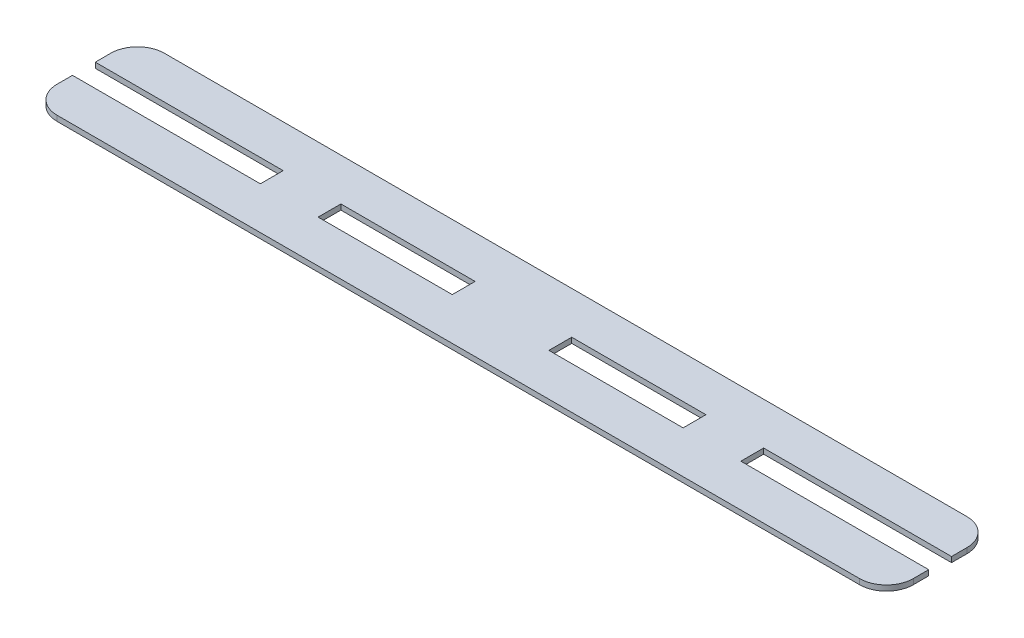
ISO-10303-21;
HEADER;
FILE_DESCRIPTION(('STEP AP214'),'2;1');
FILE_NAME('part.step','',(''),(''),'','','');
FILE_SCHEMA(('AUTOMOTIVE_DESIGN { 1 0 10303 214 1 1 1 1 }'));
ENDSEC;
DATA;
#1=APPLICATION_CONTEXT('core data for automotive mechanical design processes');
#2=APPLICATION_PROTOCOL_DEFINITION('international standard','automotive_design',2000,#1);
#3=PRODUCT_CONTEXT('',#1,'mechanical');
#4=PRODUCT('Part','Part','',(#3));
#5=PRODUCT_RELATED_PRODUCT_CATEGORY('part','',(#4));
#6=PRODUCT_DEFINITION_FORMATION('','',#4);
#7=PRODUCT_DEFINITION_CONTEXT('part definition',#1,'design');
#8=PRODUCT_DEFINITION('design','',#6,#7);
#9=PRODUCT_DEFINITION_SHAPE('','',#8);
#10=(LENGTH_UNIT() NAMED_UNIT(*) SI_UNIT(.MILLI.,.METRE.));
#11=(NAMED_UNIT(*) PLANE_ANGLE_UNIT() SI_UNIT($,.RADIAN.));
#12=(NAMED_UNIT(*) SI_UNIT($,.STERADIAN.) SOLID_ANGLE_UNIT());
#13=UNCERTAINTY_MEASURE_WITH_UNIT(LENGTH_MEASURE(1.E-05),#10,'distance_accuracy_value','');
#14=(GEOMETRIC_REPRESENTATION_CONTEXT(3) GLOBAL_UNCERTAINTY_ASSIGNED_CONTEXT((#13)) GLOBAL_UNIT_ASSIGNED_CONTEXT((#10,
#11,#12)) REPRESENTATION_CONTEXT('',''));
#15=CARTESIAN_POINT('',(0.,0.,0.));
#16=DIRECTION('',(0.,0.,1.));
#17=DIRECTION('',(1.,0.,0.));
#18=AXIS2_PLACEMENT_3D('',#15,#16,#17);
#19=CARTESIAN_POINT('',(0.,2.,0.));
#20=DIRECTION('',(0.,1.,0.));
#21=DIRECTION('',(0.,0.,1.));
#22=AXIS2_PLACEMENT_3D('',#19,#20,#21);
#23=PLANE('',#22);
#24=DIRECTION('',(0.,0.,1.));
#25=VECTOR('',#24,1.);
#26=CARTESIAN_POINT('',(91.5,2.,15.75));
#27=LINE('',#26,#25);
#28=CARTESIAN_POINT('',(91.5,2.,15.75));
#29=VERTEX_POINT('',#28);
#30=CARTESIAN_POINT('',(91.5,2.,24.25));
#31=VERTEX_POINT('',#30);
#32=EDGE_CURVE('E293',#29,#31,#27,.T.);
#33=ORIENTED_EDGE('',*,*,#32,.F.);
#34=DIRECTION('',(-1.,0.,0.));
#35=VECTOR('',#34,1.);
#36=CARTESIAN_POINT('',(91.5,2.,15.75));
#37=LINE('',#36,#35);
#38=CARTESIAN_POINT('',(141.5,2.,15.75));
#39=VERTEX_POINT('',#38);
#40=EDGE_CURVE('E306',#39,#29,#37,.T.);
#41=ORIENTED_EDGE('',*,*,#40,.F.);
#42=DIRECTION('',(0.,0.,-1.));
#43=VECTOR('',#42,1.);
#44=CARTESIAN_POINT('',(141.5,2.,15.75));
#45=LINE('',#44,#43);
#46=CARTESIAN_POINT('',(141.5,2.,24.25));
#47=VERTEX_POINT('',#46);
#48=EDGE_CURVE('E325',#47,#39,#45,.T.);
#49=ORIENTED_EDGE('',*,*,#48,.F.);
#50=DIRECTION('',(1.,0.,0.));
#51=VECTOR('',#50,1.);
#52=CARTESIAN_POINT('',(91.5,2.,24.25));
#53=LINE('',#52,#51);
#54=EDGE_CURVE('E321',#31,#47,#53,.T.);
#55=ORIENTED_EDGE('',*,*,#54,.F.);
#56=EDGE_LOOP('',(#33,#41,#49,#55));
#57=FACE_BOUND('',#56,.T.);
#58=DIRECTION('',(0.,0.,1.));
#59=VECTOR('',#58,1.);
#60=CARTESIAN_POINT('',(0.,2.,0.));
#61=LINE('',#60,#59);
#62=CARTESIAN_POINT('',(0.,2.,24.25));
#63=VERTEX_POINT('',#62);
#64=CARTESIAN_POINT('',(0.,2.,30.));
#65=VERTEX_POINT('',#64);
#66=EDGE_CURVE('E386',#63,#65,#61,.T.);
#67=ORIENTED_EDGE('',*,*,#66,.T.);
#68=CARTESIAN_POINT('',(10.,2.,30.));
#69=DIRECTION('',(0.,1.,0.));
#70=DIRECTION('',(0.,0.,1.));
#71=AXIS2_PLACEMENT_3D('',#68,#69,#70);
#72=CIRCLE('',#71,10.);
#73=CARTESIAN_POINT('',(10.,2.,40.));
#74=VERTEX_POINT('',#73);
#75=EDGE_CURVE('E431',#65,#74,#72,.T.);
#76=ORIENTED_EDGE('',*,*,#75,.T.);
#77=DIRECTION('',(1.,0.,0.));
#78=VECTOR('',#77,1.);
#79=CARTESIAN_POINT('',(0.,2.,40.));
#80=LINE('',#79,#78);
#81=CARTESIAN_POINT('',(309.,2.,40.));
#82=VERTEX_POINT('',#81);
#83=EDGE_CURVE('E385',#74,#82,#80,.T.);
#84=ORIENTED_EDGE('',*,*,#83,.T.);
#85=CARTESIAN_POINT('',(309.,2.,30.));
#86=DIRECTION('',(0.,1.,0.));
#87=DIRECTION('',(0.,0.,1.));
#88=AXIS2_PLACEMENT_3D('',#85,#86,#87);
#89=CIRCLE('',#88,10.);
#90=CARTESIAN_POINT('',(319.,2.,30.));
#91=VERTEX_POINT('',#90);
#92=EDGE_CURVE('E428',#82,#91,#89,.T.);
#93=ORIENTED_EDGE('',*,*,#92,.T.);
#94=DIRECTION('',(0.,0.,-1.));
#95=VECTOR('',#94,1.);
#96=CARTESIAN_POINT('',(319.,2.,0.));
#97=LINE('',#96,#95);
#98=CARTESIAN_POINT('',(319.,2.,24.25));
#99=VERTEX_POINT('',#98);
#100=EDGE_CURVE('E391',#91,#99,#97,.T.);
#101=ORIENTED_EDGE('',*,*,#100,.T.);
#102=DIRECTION('',(-1.,0.,0.));
#103=VECTOR('',#102,1.);
#104=CARTESIAN_POINT('',(319.,2.,24.25));
#105=LINE('',#104,#103);
#106=CARTESIAN_POINT('',(249.,2.,24.25));
#107=VERTEX_POINT('',#106);
#108=EDGE_CURVE('E271',#99,#107,#105,.T.);
#109=ORIENTED_EDGE('',*,*,#108,.T.);
#110=DIRECTION('',(0.,0.,-1.));
#111=VECTOR('',#110,1.);
#112=CARTESIAN_POINT('',(249.,2.,24.25));
#113=LINE('',#112,#111);
#114=CARTESIAN_POINT('',(249.,2.,15.75));
#115=VERTEX_POINT('',#114);
#116=EDGE_CURVE('E282',#107,#115,#113,.T.);
#117=ORIENTED_EDGE('',*,*,#116,.T.);
#118=DIRECTION('',(1.,0.,0.));
#119=VECTOR('',#118,1.);
#120=CARTESIAN_POINT('',(319.,2.,15.75));
#121=LINE('',#120,#119);
#122=CARTESIAN_POINT('',(319.,2.,15.75));
#123=VERTEX_POINT('',#122);
#124=EDGE_CURVE('E261',#115,#123,#121,.T.);
#125=ORIENTED_EDGE('',*,*,#124,.T.);
#126=CARTESIAN_POINT('',(319.,2.,10.));
#127=VERTEX_POINT('',#126);
#128=EDGE_CURVE('E390',#123,#127,#97,.T.);
#129=ORIENTED_EDGE('',*,*,#128,.T.);
#130=CARTESIAN_POINT('',(309.,2.,10.));
#131=DIRECTION('',(0.,1.,0.));
#132=DIRECTION('',(0.,0.,1.));
#133=AXIS2_PLACEMENT_3D('',#130,#131,#132);
#134=CIRCLE('',#133,10.);
#135=CARTESIAN_POINT('',(309.,2.,0.));
#136=VERTEX_POINT('',#135);
#137=EDGE_CURVE('E426',#127,#136,#134,.T.);
#138=ORIENTED_EDGE('',*,*,#137,.T.);
#139=DIRECTION('',(-1.,0.,0.));
#140=VECTOR('',#139,1.);
#141=CARTESIAN_POINT('',(0.,2.,0.));
#142=LINE('',#141,#140);
#143=CARTESIAN_POINT('',(10.,2.,0.));
#144=VERTEX_POINT('',#143);
#145=EDGE_CURVE('E394',#136,#144,#142,.T.);
#146=ORIENTED_EDGE('',*,*,#145,.T.);
#147=CARTESIAN_POINT('',(10.,2.,10.));
#148=DIRECTION('',(0.,1.,0.));
#149=DIRECTION('',(0.,0.,1.));
#150=AXIS2_PLACEMENT_3D('',#147,#148,#149);
#151=CIRCLE('',#150,10.);
#152=CARTESIAN_POINT('',(0.,2.,10.));
#153=VERTEX_POINT('',#152);
#154=EDGE_CURVE('E64',#144,#153,#151,.T.);
#155=ORIENTED_EDGE('',*,*,#154,.T.);
#156=CARTESIAN_POINT('',(0.,2.,15.75));
#157=VERTEX_POINT('',#156);
#158=EDGE_CURVE('E382',#153,#157,#61,.T.);
#159=ORIENTED_EDGE('',*,*,#158,.T.);
#160=DIRECTION('',(-1.,0.,0.));
#161=VECTOR('',#160,1.);
#162=CARTESIAN_POINT('',(0.,2.,15.75));
#163=LINE('',#162,#161);
#164=CARTESIAN_POINT('',(70.,2.,15.75));
#165=VERTEX_POINT('',#164);
#166=EDGE_CURVE('E350',#165,#157,#163,.T.);
#167=ORIENTED_EDGE('',*,*,#166,.F.);
#168=DIRECTION('',(0.,0.,-1.));
#169=VECTOR('',#168,1.);
#170=CARTESIAN_POINT('',(70.,2.,24.25));
#171=LINE('',#170,#169);
#172=CARTESIAN_POINT('',(70.,2.,24.25));
#173=VERTEX_POINT('',#172);
#174=EDGE_CURVE('E362',#173,#165,#171,.T.);
#175=ORIENTED_EDGE('',*,*,#174,.F.);
#176=DIRECTION('',(1.,0.,0.));
#177=VECTOR('',#176,1.);
#178=CARTESIAN_POINT('',(0.,2.,24.25));
#179=LINE('',#178,#177);
#180=EDGE_CURVE('E335',#63,#173,#179,.T.);
#181=ORIENTED_EDGE('',*,*,#180,.F.);
#182=EDGE_LOOP('',(#67,#76,#84,#93,#101,#109,#117,#125,#129,#138,#146,#155,#159,#167,#175,#181));
#183=FACE_BOUND('',#182,.T.);
#184=DIRECTION('',(1.,0.,0.));
#185=VECTOR('',#184,1.);
#186=CARTESIAN_POINT('',(227.5,2.,15.75));
#187=LINE('',#186,#185);
#188=CARTESIAN_POINT('',(177.5,2.,15.75));
#189=VERTEX_POINT('',#188);
#190=CARTESIAN_POINT('',(227.5,2.,15.75));
#191=VERTEX_POINT('',#190);
#192=EDGE_CURVE('E252',#189,#191,#187,.T.);
#193=ORIENTED_EDGE('',*,*,#192,.T.);
#194=DIRECTION('',(0.,0.,1.));
#195=VECTOR('',#194,1.);
#196=CARTESIAN_POINT('',(227.5,2.,15.75));
#197=LINE('',#196,#195);
#198=CARTESIAN_POINT('',(227.5,2.,24.25));
#199=VERTEX_POINT('',#198);
#200=EDGE_CURVE('E231',#191,#199,#197,.T.);
#201=ORIENTED_EDGE('',*,*,#200,.T.);
#202=DIRECTION('',(-1.,0.,0.));
#203=VECTOR('',#202,1.);
#204=CARTESIAN_POINT('',(227.5,2.,24.25));
#205=LINE('',#204,#203);
#206=CARTESIAN_POINT('',(177.5,2.,24.25));
#207=VERTEX_POINT('',#206);
#208=EDGE_CURVE('E238',#199,#207,#205,.T.);
#209=ORIENTED_EDGE('',*,*,#208,.T.);
#210=DIRECTION('',(0.,0.,-1.));
#211=VECTOR('',#210,1.);
#212=CARTESIAN_POINT('',(177.5,2.,15.75));
#213=LINE('',#212,#211);
#214=EDGE_CURVE('E243',#207,#189,#213,.T.);
#215=ORIENTED_EDGE('',*,*,#214,.T.);
#216=EDGE_LOOP('',(#193,#201,#209,#215));
#217=FACE_BOUND('',#216,.T.);
#218=ADVANCED_FACE('F49',(#57,#183,#217),#23,.T.);
#219=CARTESIAN_POINT('',(0.,0.,0.));
#220=DIRECTION('',(0.,1.,0.));
#221=DIRECTION('',(0.,0.,1.));
#222=AXIS2_PLACEMENT_3D('',#219,#220,#221);
#223=PLANE('',#222);
#224=DIRECTION('',(1.,0.,0.));
#225=VECTOR('',#224,1.);
#226=CARTESIAN_POINT('',(0.,0.,40.));
#227=LINE('',#226,#225);
#228=CARTESIAN_POINT('',(10.,0.,40.));
#229=VERTEX_POINT('',#228);
#230=CARTESIAN_POINT('',(309.,0.,40.));
#231=VERTEX_POINT('',#230);
#232=EDGE_CURVE('E401',#229,#231,#227,.T.);
#233=ORIENTED_EDGE('',*,*,#232,.F.);
#234=CARTESIAN_POINT('',(10.,0.,30.));
#235=DIRECTION('',(0.,1.,0.));
#236=DIRECTION('',(0.,0.,1.));
#237=AXIS2_PLACEMENT_3D('',#234,#235,#236);
#238=CIRCLE('',#237,10.);
#239=CARTESIAN_POINT('',(0.,0.,30.));
#240=VERTEX_POINT('',#239);
#241=EDGE_CURVE('E422',#229,#240,#238,.F.);
#242=ORIENTED_EDGE('',*,*,#241,.T.);
#243=DIRECTION('',(0.,0.,1.));
#244=VECTOR('',#243,1.);
#245=CARTESIAN_POINT('',(0.,0.,0.));
#246=LINE('',#245,#244);
#247=CARTESIAN_POINT('',(0.,0.,24.25));
#248=VERTEX_POINT('',#247);
#249=EDGE_CURVE('E373',#248,#240,#246,.T.);
#250=ORIENTED_EDGE('',*,*,#249,.F.);
#251=DIRECTION('',(1.,0.,0.));
#252=VECTOR('',#251,1.);
#253=CARTESIAN_POINT('',(0.,0.,24.25));
#254=LINE('',#253,#252);
#255=CARTESIAN_POINT('',(70.,0.,24.25));
#256=VERTEX_POINT('',#255);
#257=EDGE_CURVE('E345',#248,#256,#254,.T.);
#258=ORIENTED_EDGE('',*,*,#257,.T.);
#259=DIRECTION('',(0.,0.,-1.));
#260=VECTOR('',#259,1.);
#261=CARTESIAN_POINT('',(70.,0.,24.25));
#262=LINE('',#261,#260);
#263=CARTESIAN_POINT('',(70.,0.,15.75));
#264=VERTEX_POINT('',#263);
#265=EDGE_CURVE('E349',#256,#264,#262,.T.);
#266=ORIENTED_EDGE('',*,*,#265,.T.);
#267=DIRECTION('',(-1.,0.,0.));
#268=VECTOR('',#267,1.);
#269=CARTESIAN_POINT('',(0.,0.,15.75));
#270=LINE('',#269,#268);
#271=CARTESIAN_POINT('',(0.,0.,15.75));
#272=VERTEX_POINT('',#271);
#273=EDGE_CURVE('E354',#264,#272,#270,.T.);
#274=ORIENTED_EDGE('',*,*,#273,.T.);
#275=CARTESIAN_POINT('',(0.,0.,10.));
#276=VERTEX_POINT('',#275);
#277=EDGE_CURVE('E398',#276,#272,#246,.T.);
#278=ORIENTED_EDGE('',*,*,#277,.F.);
#279=CARTESIAN_POINT('',(10.,0.,10.));
#280=DIRECTION('',(0.,1.,0.));
#281=DIRECTION('',(0.,0.,1.));
#282=AXIS2_PLACEMENT_3D('',#279,#280,#281);
#283=CIRCLE('',#282,10.);
#284=CARTESIAN_POINT('',(10.,0.,0.));
#285=VERTEX_POINT('',#284);
#286=EDGE_CURVE('E420',#276,#285,#283,.F.);
#287=ORIENTED_EDGE('',*,*,#286,.T.);
#288=DIRECTION('',(-1.,0.,0.));
#289=VECTOR('',#288,1.);
#290=CARTESIAN_POINT('',(0.,0.,0.));
#291=LINE('',#290,#289);
#292=CARTESIAN_POINT('',(309.,0.,0.));
#293=VERTEX_POINT('',#292);
#294=EDGE_CURVE('E409',#293,#285,#291,.T.);
#295=ORIENTED_EDGE('',*,*,#294,.F.);
#296=CARTESIAN_POINT('',(309.,0.,10.));
#297=DIRECTION('',(0.,1.,0.));
#298=DIRECTION('',(0.,0.,1.));
#299=AXIS2_PLACEMENT_3D('',#296,#297,#298);
#300=CIRCLE('',#299,10.);
#301=CARTESIAN_POINT('',(319.,0.,10.));
#302=VERTEX_POINT('',#301);
#303=EDGE_CURVE('E416',#293,#302,#300,.F.);
#304=ORIENTED_EDGE('',*,*,#303,.T.);
#305=DIRECTION('',(0.,0.,-1.));
#306=VECTOR('',#305,1.);
#307=CARTESIAN_POINT('',(319.,0.,0.));
#308=LINE('',#307,#306);
#309=CARTESIAN_POINT('',(319.,0.,15.75));
#310=VERTEX_POINT('',#309);
#311=EDGE_CURVE('E405',#310,#302,#308,.T.);
#312=ORIENTED_EDGE('',*,*,#311,.F.);
#313=DIRECTION('',(1.,0.,0.));
#314=VECTOR('',#313,1.);
#315=CARTESIAN_POINT('',(319.,0.,15.75));
#316=LINE('',#315,#314);
#317=CARTESIAN_POINT('',(249.,0.,15.75));
#318=VERTEX_POINT('',#317);
#319=EDGE_CURVE('E267',#318,#310,#316,.T.);
#320=ORIENTED_EDGE('',*,*,#319,.F.);
#321=DIRECTION('',(0.,0.,-1.));
#322=VECTOR('',#321,1.);
#323=CARTESIAN_POINT('',(249.,0.,24.25));
#324=LINE('',#323,#322);
#325=CARTESIAN_POINT('',(249.,0.,24.25));
#326=VERTEX_POINT('',#325);
#327=EDGE_CURVE('E270',#326,#318,#324,.T.);
#328=ORIENTED_EDGE('',*,*,#327,.F.);
#329=DIRECTION('',(-1.,0.,0.));
#330=VECTOR('',#329,1.);
#331=CARTESIAN_POINT('',(319.,0.,24.25));
#332=LINE('',#331,#330);
#333=CARTESIAN_POINT('',(319.,0.,24.25));
#334=VERTEX_POINT('',#333);
#335=EDGE_CURVE('E275',#334,#326,#332,.T.);
#336=ORIENTED_EDGE('',*,*,#335,.F.);
#337=CARTESIAN_POINT('',(319.,0.,30.));
#338=VERTEX_POINT('',#337);
#339=EDGE_CURVE('E406',#338,#334,#308,.T.);
#340=ORIENTED_EDGE('',*,*,#339,.F.);
#341=CARTESIAN_POINT('',(309.,0.,30.));
#342=DIRECTION('',(0.,1.,0.));
#343=DIRECTION('',(0.,0.,1.));
#344=AXIS2_PLACEMENT_3D('',#341,#342,#343);
#345=CIRCLE('',#344,10.);
#346=EDGE_CURVE('E418',#338,#231,#345,.F.);
#347=ORIENTED_EDGE('',*,*,#346,.T.);
#348=EDGE_LOOP('',(#233,#242,#250,#258,#266,#274,#278,#287,#295,#304,#312,#320,#328,#336,#340,#347));
#349=FACE_BOUND('',#348,.T.);
#350=DIRECTION('',(-1.,0.,0.));
#351=VECTOR('',#350,1.);
#352=CARTESIAN_POINT('',(91.5,0.,15.75));
#353=LINE('',#352,#351);
#354=CARTESIAN_POINT('',(141.5,0.,15.75));
#355=VERTEX_POINT('',#354);
#356=CARTESIAN_POINT('',(91.5,0.,15.75));
#357=VERTEX_POINT('',#356);
#358=EDGE_CURVE('E314',#355,#357,#353,.T.);
#359=ORIENTED_EDGE('',*,*,#358,.T.);
#360=DIRECTION('',(0.,0.,1.));
#361=VECTOR('',#360,1.);
#362=CARTESIAN_POINT('',(91.5,0.,15.75));
#363=LINE('',#362,#361);
#364=CARTESIAN_POINT('',(91.5,0.,24.25));
#365=VERTEX_POINT('',#364);
#366=EDGE_CURVE('E302',#357,#365,#363,.T.);
#367=ORIENTED_EDGE('',*,*,#366,.T.);
#368=DIRECTION('',(1.,0.,0.));
#369=VECTOR('',#368,1.);
#370=CARTESIAN_POINT('',(91.5,0.,24.25));
#371=LINE('',#370,#369);
#372=CARTESIAN_POINT('',(141.5,0.,24.25));
#373=VERTEX_POINT('',#372);
#374=EDGE_CURVE('E305',#365,#373,#371,.T.);
#375=ORIENTED_EDGE('',*,*,#374,.T.);
#376=DIRECTION('',(0.,0.,-1.));
#377=VECTOR('',#376,1.);
#378=CARTESIAN_POINT('',(141.5,0.,15.75));
#379=LINE('',#378,#377);
#380=EDGE_CURVE('E310',#373,#355,#379,.T.);
#381=ORIENTED_EDGE('',*,*,#380,.T.);
#382=EDGE_LOOP('',(#359,#367,#375,#381));
#383=FACE_BOUND('',#382,.T.);
#384=DIRECTION('',(0.,0.,1.));
#385=VECTOR('',#384,1.);
#386=CARTESIAN_POINT('',(227.5,0.,15.75));
#387=LINE('',#386,#385);
#388=CARTESIAN_POINT('',(227.5,0.,15.75));
#389=VERTEX_POINT('',#388);
#390=CARTESIAN_POINT('',(227.5,0.,24.25));
#391=VERTEX_POINT('',#390);
#392=EDGE_CURVE('E224',#389,#391,#387,.T.);
#393=ORIENTED_EDGE('',*,*,#392,.F.);
#394=DIRECTION('',(1.,0.,0.));
#395=VECTOR('',#394,1.);
#396=CARTESIAN_POINT('',(227.5,0.,15.75));
#397=LINE('',#396,#395);
#398=CARTESIAN_POINT('',(177.5,0.,15.75));
#399=VERTEX_POINT('',#398);
#400=EDGE_CURVE('E211',#399,#389,#397,.T.);
#401=ORIENTED_EDGE('',*,*,#400,.F.);
#402=DIRECTION('',(0.,0.,-1.));
#403=VECTOR('',#402,1.);
#404=CARTESIAN_POINT('',(177.5,0.,15.75));
#405=LINE('',#404,#403);
#406=CARTESIAN_POINT('',(177.5,0.,24.25));
#407=VERTEX_POINT('',#406);
#408=EDGE_CURVE('E223',#407,#399,#405,.T.);
#409=ORIENTED_EDGE('',*,*,#408,.F.);
#410=DIRECTION('',(-1.,0.,0.));
#411=VECTOR('',#410,1.);
#412=CARTESIAN_POINT('',(227.5,0.,24.25));
#413=LINE('',#412,#411);
#414=EDGE_CURVE('E233',#391,#407,#413,.T.);
#415=ORIENTED_EDGE('',*,*,#414,.F.);
#416=EDGE_LOOP('',(#393,#401,#409,#415));
#417=FACE_BOUND('',#416,.T.);
#418=ADVANCED_FACE('F236',(#349,#383,#417),#223,.F.);
#419=CARTESIAN_POINT('',(319.,2.,0.));
#420=DIRECTION('',(-1.,0.,0.));
#421=DIRECTION('',(0.,0.,1.));
#422=AXIS2_PLACEMENT_3D('',#419,#420,#421);
#423=PLANE('',#422);
#424=ORIENTED_EDGE('',*,*,#100,.F.);
#425=DIRECTION('',(0.,-1.,0.));
#426=VECTOR('',#425,1.);
#427=CARTESIAN_POINT('',(319.,2.,30.));
#428=LINE('',#427,#426);
#429=EDGE_CURVE('E57',#91,#338,#428,.T.);
#430=ORIENTED_EDGE('',*,*,#429,.T.);
#431=ORIENTED_EDGE('',*,*,#339,.T.);
#432=DIRECTION('',(0.,1.,0.));
#433=VECTOR('',#432,1.);
#434=CARTESIAN_POINT('',(319.,0.,24.25));
#435=LINE('',#434,#433);
#436=EDGE_CURVE('E289',#334,#99,#435,.T.);
#437=ORIENTED_EDGE('',*,*,#436,.T.);
#438=EDGE_LOOP('',(#424,#430,#431,#437));
#439=FACE_BOUND('',#438,.T.);
#440=ADVANCED_FACE('F444',(#439),#423,.F.);
#441=ORIENTED_EDGE('',*,*,#311,.T.);
#442=DIRECTION('',(0.,-1.,0.));
#443=VECTOR('',#442,1.);
#444=CARTESIAN_POINT('',(319.,2.,10.));
#445=LINE('',#444,#443);
#446=EDGE_CURVE('E11',#302,#127,#445,.F.);
#447=ORIENTED_EDGE('',*,*,#446,.T.);
#448=ORIENTED_EDGE('',*,*,#128,.F.);
#449=DIRECTION('',(0.,1.,0.));
#450=VECTOR('',#449,1.);
#451=CARTESIAN_POINT('',(319.,0.,15.75));
#452=LINE('',#451,#450);
#453=EDGE_CURVE('E278',#310,#123,#452,.T.);
#454=ORIENTED_EDGE('',*,*,#453,.F.);
#455=EDGE_LOOP('',(#441,#447,#448,#454));
#456=FACE_BOUND('',#455,.T.);
#457=ADVANCED_FACE('F526',(#456),#423,.F.);
#458=CARTESIAN_POINT('',(0.,2.,0.));
#459=DIRECTION('',(1.,0.,0.));
#460=DIRECTION('',(0.,0.,-1.));
#461=AXIS2_PLACEMENT_3D('',#458,#459,#460);
#462=PLANE('',#461);
#463=ORIENTED_EDGE('',*,*,#158,.F.);
#464=DIRECTION('',(0.,-1.,0.));
#465=VECTOR('',#464,1.);
#466=CARTESIAN_POINT('',(0.,2.,10.));
#467=LINE('',#466,#465);
#468=EDGE_CURVE('E433',#153,#276,#467,.T.);
#469=ORIENTED_EDGE('',*,*,#468,.T.);
#470=ORIENTED_EDGE('',*,*,#277,.T.);
#471=DIRECTION('',(0.,1.,0.));
#472=VECTOR('',#471,1.);
#473=CARTESIAN_POINT('',(0.,0.,15.75));
#474=LINE('',#473,#472);
#475=EDGE_CURVE('E369',#272,#157,#474,.T.);
#476=ORIENTED_EDGE('',*,*,#475,.T.);
#477=EDGE_LOOP('',(#463,#469,#470,#476));
#478=FACE_BOUND('',#477,.T.);
#479=ADVANCED_FACE('F496',(#478),#462,.F.);
#480=ORIENTED_EDGE('',*,*,#249,.T.);
#481=DIRECTION('',(0.,-1.,0.));
#482=VECTOR('',#481,1.);
#483=CARTESIAN_POINT('',(0.,2.,30.));
#484=LINE('',#483,#482);
#485=EDGE_CURVE('E424',#240,#65,#484,.F.);
#486=ORIENTED_EDGE('',*,*,#485,.T.);
#487=ORIENTED_EDGE('',*,*,#66,.F.);
#488=DIRECTION('',(0.,1.,0.));
#489=VECTOR('',#488,1.);
#490=CARTESIAN_POINT('',(0.,0.,24.25));
#491=LINE('',#490,#489);
#492=EDGE_CURVE('E358',#248,#63,#491,.T.);
#493=ORIENTED_EDGE('',*,*,#492,.F.);
#494=EDGE_LOOP('',(#480,#486,#487,#493));
#495=FACE_BOUND('',#494,.T.);
#496=ADVANCED_FACE('F476',(#495),#462,.F.);
#497=CARTESIAN_POINT('',(0.,2.,40.));
#498=DIRECTION('',(0.,0.,-1.));
#499=DIRECTION('',(-1.,0.,0.));
#500=AXIS2_PLACEMENT_3D('',#497,#498,#499);
#501=PLANE('',#500);
#502=ORIENTED_EDGE('',*,*,#83,.F.);
#503=DIRECTION('',(0.,-1.,0.));
#504=VECTOR('',#503,1.);
#505=CARTESIAN_POINT('',(10.,2.,40.));
#506=LINE('',#505,#504);
#507=EDGE_CURVE('E413',#74,#229,#506,.T.);
#508=ORIENTED_EDGE('',*,*,#507,.T.);
#509=ORIENTED_EDGE('',*,*,#232,.T.);
#510=DIRECTION('',(0.,-1.,0.));
#511=VECTOR('',#510,1.);
#512=CARTESIAN_POINT('',(309.,2.,40.));
#513=LINE('',#512,#511);
#514=EDGE_CURVE('E397',#231,#82,#513,.F.);
#515=ORIENTED_EDGE('',*,*,#514,.T.);
#516=EDGE_LOOP('',(#502,#508,#509,#515));
#517=FACE_BOUND('',#516,.T.);
#518=ADVANCED_FACE('F468',(#517),#501,.F.);
#519=CARTESIAN_POINT('',(0.,2.,0.));
#520=DIRECTION('',(0.,0.,1.));
#521=DIRECTION('',(1.,0.,0.));
#522=AXIS2_PLACEMENT_3D('',#519,#520,#521);
#523=PLANE('',#522);
#524=ORIENTED_EDGE('',*,*,#294,.T.);
#525=DIRECTION('',(0.,-1.,0.));
#526=VECTOR('',#525,1.);
#527=CARTESIAN_POINT('',(10.,2.,0.));
#528=LINE('',#527,#526);
#529=EDGE_CURVE('E72',#285,#144,#528,.F.);
#530=ORIENTED_EDGE('',*,*,#529,.T.);
#531=ORIENTED_EDGE('',*,*,#145,.F.);
#532=DIRECTION('',(0.,-1.,0.));
#533=VECTOR('',#532,1.);
#534=CARTESIAN_POINT('',(309.,2.,0.));
#535=LINE('',#534,#533);
#536=EDGE_CURVE('E436',#136,#293,#535,.T.);
#537=ORIENTED_EDGE('',*,*,#536,.T.);
#538=EDGE_LOOP('',(#524,#530,#531,#537));
#539=FACE_BOUND('',#538,.T.);
#540=ADVANCED_FACE('F500',(#539),#523,.F.);
#541=CARTESIAN_POINT('',(0.,0.,15.75));
#542=DIRECTION('',(0.,0.,-1.));
#543=DIRECTION('',(-1.,0.,0.));
#544=AXIS2_PLACEMENT_3D('',#541,#542,#543);
#545=PLANE('',#544);
#546=ORIENTED_EDGE('',*,*,#166,.T.);
#547=ORIENTED_EDGE('',*,*,#475,.F.);
#548=ORIENTED_EDGE('',*,*,#273,.F.);
#549=DIRECTION('',(0.,1.,0.));
#550=VECTOR('',#549,1.);
#551=CARTESIAN_POINT('',(70.,0.,15.75));
#552=LINE('',#551,#550);
#553=EDGE_CURVE('E374',#264,#165,#552,.T.);
#554=ORIENTED_EDGE('',*,*,#553,.T.);
#555=EDGE_LOOP('',(#546,#547,#548,#554));
#556=FACE_BOUND('',#555,.T.);
#557=ADVANCED_FACE('F494',(#556),#545,.F.);
#558=CARTESIAN_POINT('',(70.,0.,24.25));
#559=DIRECTION('',(1.,0.,0.));
#560=DIRECTION('',(0.,0.,-1.));
#561=AXIS2_PLACEMENT_3D('',#558,#559,#560);
#562=PLANE('',#561);
#563=ORIENTED_EDGE('',*,*,#174,.T.);
#564=ORIENTED_EDGE('',*,*,#553,.F.);
#565=ORIENTED_EDGE('',*,*,#265,.F.);
#566=DIRECTION('',(0.,1.,0.));
#567=VECTOR('',#566,1.);
#568=CARTESIAN_POINT('',(70.,0.,24.25));
#569=LINE('',#568,#567);
#570=EDGE_CURVE('E377',#256,#173,#569,.T.);
#571=ORIENTED_EDGE('',*,*,#570,.T.);
#572=EDGE_LOOP('',(#563,#564,#565,#571));
#573=FACE_BOUND('',#572,.T.);
#574=ADVANCED_FACE('F491',(#573),#562,.F.);
#575=CARTESIAN_POINT('',(0.,0.,24.25));
#576=DIRECTION('',(0.,0.,1.));
#577=DIRECTION('',(1.,0.,0.));
#578=AXIS2_PLACEMENT_3D('',#575,#576,#577);
#579=PLANE('',#578);
#580=ORIENTED_EDGE('',*,*,#180,.T.);
#581=ORIENTED_EDGE('',*,*,#570,.F.);
#582=ORIENTED_EDGE('',*,*,#257,.F.);
#583=ORIENTED_EDGE('',*,*,#492,.T.);
#584=EDGE_LOOP('',(#580,#581,#582,#583));
#585=FACE_BOUND('',#584,.T.);
#586=ADVANCED_FACE('F487',(#585),#579,.F.);
#587=CARTESIAN_POINT('',(91.5,0.,15.75));
#588=DIRECTION('',(-1.,0.,0.));
#589=DIRECTION('',(0.,0.,1.));
#590=AXIS2_PLACEMENT_3D('',#587,#588,#589);
#591=PLANE('',#590);
#592=ORIENTED_EDGE('',*,*,#32,.T.);
#593=DIRECTION('',(0.,1.,0.));
#594=VECTOR('',#593,1.);
#595=CARTESIAN_POINT('',(91.5,0.,24.25));
#596=LINE('',#595,#594);
#597=EDGE_CURVE('E318',#365,#31,#596,.T.);
#598=ORIENTED_EDGE('',*,*,#597,.F.);
#599=ORIENTED_EDGE('',*,*,#366,.F.);
#600=DIRECTION('',(0.,1.,0.));
#601=VECTOR('',#600,1.);
#602=CARTESIAN_POINT('',(91.5,0.,15.75));
#603=LINE('',#602,#601);
#604=EDGE_CURVE('E332',#357,#29,#603,.T.);
#605=ORIENTED_EDGE('',*,*,#604,.T.);
#606=EDGE_LOOP('',(#592,#598,#599,#605));
#607=FACE_BOUND('',#606,.T.);
#608=ADVANCED_FACE('F565',(#607),#591,.F.);
#609=CARTESIAN_POINT('',(91.5,0.,15.75));
#610=DIRECTION('',(0.,0.,-1.));
#611=DIRECTION('',(-1.,0.,0.));
#612=AXIS2_PLACEMENT_3D('',#609,#610,#611);
#613=PLANE('',#612);
#614=ORIENTED_EDGE('',*,*,#40,.T.);
#615=ORIENTED_EDGE('',*,*,#604,.F.);
#616=ORIENTED_EDGE('',*,*,#358,.F.);
#617=DIRECTION('',(0.,1.,0.));
#618=VECTOR('',#617,1.);
#619=CARTESIAN_POINT('',(141.5,0.,15.75));
#620=LINE('',#619,#618);
#621=EDGE_CURVE('E336',#355,#39,#620,.T.);
#622=ORIENTED_EDGE('',*,*,#621,.T.);
#623=EDGE_LOOP('',(#614,#615,#616,#622));
#624=FACE_BOUND('',#623,.T.);
#625=ADVANCED_FACE('F561',(#624),#613,.F.);
#626=CARTESIAN_POINT('',(141.5,0.,15.75));
#627=DIRECTION('',(1.,0.,0.));
#628=DIRECTION('',(0.,0.,-1.));
#629=AXIS2_PLACEMENT_3D('',#626,#627,#628);
#630=PLANE('',#629);
#631=ORIENTED_EDGE('',*,*,#48,.T.);
#632=ORIENTED_EDGE('',*,*,#621,.F.);
#633=ORIENTED_EDGE('',*,*,#380,.F.);
#634=DIRECTION('',(0.,1.,0.));
#635=VECTOR('',#634,1.);
#636=CARTESIAN_POINT('',(141.5,0.,24.25));
#637=LINE('',#636,#635);
#638=EDGE_CURVE('E339',#373,#47,#637,.T.);
#639=ORIENTED_EDGE('',*,*,#638,.T.);
#640=EDGE_LOOP('',(#631,#632,#633,#639));
#641=FACE_BOUND('',#640,.T.);
#642=ADVANCED_FACE('F564',(#641),#630,.F.);
#643=CARTESIAN_POINT('',(91.5,0.,24.25));
#644=DIRECTION('',(0.,0.,1.));
#645=DIRECTION('',(1.,0.,0.));
#646=AXIS2_PLACEMENT_3D('',#643,#644,#645);
#647=PLANE('',#646);
#648=ORIENTED_EDGE('',*,*,#54,.T.);
#649=ORIENTED_EDGE('',*,*,#638,.F.);
#650=ORIENTED_EDGE('',*,*,#374,.F.);
#651=ORIENTED_EDGE('',*,*,#597,.T.);
#652=EDGE_LOOP('',(#648,#649,#650,#651));
#653=FACE_BOUND('',#652,.T.);
#654=ADVANCED_FACE('F569',(#653),#647,.F.);
#655=CARTESIAN_POINT('',(319.,0.,24.25));
#656=DIRECTION('',(0.,0.,-1.));
#657=DIRECTION('',(-1.,0.,0.));
#658=AXIS2_PLACEMENT_3D('',#655,#656,#657);
#659=PLANE('',#658);
#660=ORIENTED_EDGE('',*,*,#108,.F.);
#661=ORIENTED_EDGE('',*,*,#436,.F.);
#662=ORIENTED_EDGE('',*,*,#335,.T.);
#663=DIRECTION('',(0.,1.,0.));
#664=VECTOR('',#663,1.);
#665=CARTESIAN_POINT('',(249.,0.,24.25));
#666=LINE('',#665,#664);
#667=EDGE_CURVE('E294',#326,#107,#666,.T.);
#668=ORIENTED_EDGE('',*,*,#667,.T.);
#669=EDGE_LOOP('',(#660,#661,#662,#668));
#670=FACE_BOUND('',#669,.T.);
#671=ADVANCED_FACE('F457',(#670),#659,.T.);
#672=CARTESIAN_POINT('',(249.,0.,24.25));
#673=DIRECTION('',(1.,0.,0.));
#674=DIRECTION('',(0.,0.,-1.));
#675=AXIS2_PLACEMENT_3D('',#672,#673,#674);
#676=PLANE('',#675);
#677=ORIENTED_EDGE('',*,*,#116,.F.);
#678=ORIENTED_EDGE('',*,*,#667,.F.);
#679=ORIENTED_EDGE('',*,*,#327,.T.);
#680=DIRECTION('',(0.,1.,0.));
#681=VECTOR('',#680,1.);
#682=CARTESIAN_POINT('',(249.,0.,15.75));
#683=LINE('',#682,#681);
#684=EDGE_CURVE('E297',#318,#115,#683,.T.);
#685=ORIENTED_EDGE('',*,*,#684,.T.);
#686=EDGE_LOOP('',(#677,#678,#679,#685));
#687=FACE_BOUND('',#686,.T.);
#688=ADVANCED_FACE('F460',(#687),#676,.T.);
#689=CARTESIAN_POINT('',(319.,0.,15.75));
#690=DIRECTION('',(0.,0.,1.));
#691=DIRECTION('',(1.,0.,0.));
#692=AXIS2_PLACEMENT_3D('',#689,#690,#691);
#693=PLANE('',#692);
#694=ORIENTED_EDGE('',*,*,#124,.F.);
#695=ORIENTED_EDGE('',*,*,#684,.F.);
#696=ORIENTED_EDGE('',*,*,#319,.T.);
#697=ORIENTED_EDGE('',*,*,#453,.T.);
#698=EDGE_LOOP('',(#694,#695,#696,#697));
#699=FACE_BOUND('',#698,.T.);
#700=ADVANCED_FACE('F550',(#699),#693,.T.);
#701=CARTESIAN_POINT('',(227.5,0.,15.75));
#702=DIRECTION('',(-1.,0.,0.));
#703=DIRECTION('',(0.,0.,1.));
#704=AXIS2_PLACEMENT_3D('',#701,#702,#703);
#705=PLANE('',#704);
#706=ORIENTED_EDGE('',*,*,#200,.F.);
#707=DIRECTION('',(0.,1.,0.));
#708=VECTOR('',#707,1.);
#709=CARTESIAN_POINT('',(227.5,0.,15.75));
#710=LINE('',#709,#708);
#711=EDGE_CURVE('E215',#389,#191,#710,.T.);
#712=ORIENTED_EDGE('',*,*,#711,.F.);
#713=ORIENTED_EDGE('',*,*,#392,.T.);
#714=DIRECTION('',(0.,1.,0.));
#715=VECTOR('',#714,1.);
#716=CARTESIAN_POINT('',(227.5,0.,24.25));
#717=LINE('',#716,#715);
#718=EDGE_CURVE('E258',#391,#199,#717,.T.);
#719=ORIENTED_EDGE('',*,*,#718,.T.);
#720=EDGE_LOOP('',(#706,#712,#713,#719));
#721=FACE_BOUND('',#720,.T.);
#722=ADVANCED_FACE('F227',(#721),#705,.T.);
#723=CARTESIAN_POINT('',(227.5,0.,24.25));
#724=DIRECTION('',(0.,0.,-1.));
#725=DIRECTION('',(-1.,0.,0.));
#726=AXIS2_PLACEMENT_3D('',#723,#724,#725);
#727=PLANE('',#726);
#728=ORIENTED_EDGE('',*,*,#208,.F.);
#729=ORIENTED_EDGE('',*,*,#718,.F.);
#730=ORIENTED_EDGE('',*,*,#414,.T.);
#731=DIRECTION('',(0.,1.,0.));
#732=VECTOR('',#731,1.);
#733=CARTESIAN_POINT('',(177.5,0.,24.25));
#734=LINE('',#733,#732);
#735=EDGE_CURVE('E262',#407,#207,#734,.T.);
#736=ORIENTED_EDGE('',*,*,#735,.T.);
#737=EDGE_LOOP('',(#728,#729,#730,#736));
#738=FACE_BOUND('',#737,.T.);
#739=ADVANCED_FACE('F556',(#738),#727,.T.);
#740=CARTESIAN_POINT('',(177.5,0.,15.75));
#741=DIRECTION('',(1.,0.,0.));
#742=DIRECTION('',(0.,0.,-1.));
#743=AXIS2_PLACEMENT_3D('',#740,#741,#742);
#744=PLANE('',#743);
#745=ORIENTED_EDGE('',*,*,#214,.F.);
#746=ORIENTED_EDGE('',*,*,#735,.F.);
#747=ORIENTED_EDGE('',*,*,#408,.T.);
#748=DIRECTION('',(0.,1.,0.));
#749=VECTOR('',#748,1.);
#750=CARTESIAN_POINT('',(177.5,0.,15.75));
#751=LINE('',#750,#749);
#752=EDGE_CURVE('E217',#399,#189,#751,.T.);
#753=ORIENTED_EDGE('',*,*,#752,.T.);
#754=EDGE_LOOP('',(#745,#746,#747,#753));
#755=FACE_BOUND('',#754,.T.);
#756=ADVANCED_FACE('F624',(#755),#744,.T.);
#757=CARTESIAN_POINT('',(227.5,0.,15.75));
#758=DIRECTION('',(0.,0.,1.));
#759=DIRECTION('',(1.,0.,0.));
#760=AXIS2_PLACEMENT_3D('',#757,#758,#759);
#761=PLANE('',#760);
#762=ORIENTED_EDGE('',*,*,#192,.F.);
#763=ORIENTED_EDGE('',*,*,#752,.F.);
#764=ORIENTED_EDGE('',*,*,#400,.T.);
#765=ORIENTED_EDGE('',*,*,#711,.T.);
#766=EDGE_LOOP('',(#762,#763,#764,#765));
#767=FACE_BOUND('',#766,.T.);
#768=ADVANCED_FACE('F214',(#767),#761,.T.);
#769=CARTESIAN_POINT('',(10.,2.,30.));
#770=DIRECTION('',(0.,-1.,0.));
#771=DIRECTION('',(0.,0.,-1.));
#772=AXIS2_PLACEMENT_3D('',#769,#770,#771);
#773=CYLINDRICAL_SURFACE('',#772,10.);
#774=ORIENTED_EDGE('',*,*,#75,.F.);
#775=ORIENTED_EDGE('',*,*,#485,.F.);
#776=ORIENTED_EDGE('',*,*,#241,.F.);
#777=ORIENTED_EDGE('',*,*,#507,.F.);
#778=EDGE_LOOP('',(#774,#775,#776,#777));
#779=FACE_BOUND('',#778,.T.);
#780=ADVANCED_FACE('F480',(#779),#773,.T.);
#781=CARTESIAN_POINT('',(10.,2.,10.));
#782=DIRECTION('',(0.,-1.,0.));
#783=DIRECTION('',(0.,0.,-1.));
#784=AXIS2_PLACEMENT_3D('',#781,#782,#783);
#785=CYLINDRICAL_SURFACE('',#784,10.);
#786=ORIENTED_EDGE('',*,*,#154,.F.);
#787=ORIENTED_EDGE('',*,*,#529,.F.);
#788=ORIENTED_EDGE('',*,*,#286,.F.);
#789=ORIENTED_EDGE('',*,*,#468,.F.);
#790=EDGE_LOOP('',(#786,#787,#788,#789));
#791=FACE_BOUND('',#790,.T.);
#792=ADVANCED_FACE('F502',(#791),#785,.T.);
#793=CARTESIAN_POINT('',(309.,2.,30.));
#794=DIRECTION('',(0.,-1.,0.));
#795=DIRECTION('',(0.,0.,-1.));
#796=AXIS2_PLACEMENT_3D('',#793,#794,#795);
#797=CYLINDRICAL_SURFACE('',#796,10.);
#798=ORIENTED_EDGE('',*,*,#92,.F.);
#799=ORIENTED_EDGE('',*,*,#514,.F.);
#800=ORIENTED_EDGE('',*,*,#346,.F.);
#801=ORIENTED_EDGE('',*,*,#429,.F.);
#802=EDGE_LOOP('',(#798,#799,#800,#801));
#803=FACE_BOUND('',#802,.T.);
#804=ADVANCED_FACE('F466',(#803),#797,.T.);
#805=CARTESIAN_POINT('',(309.,2.,10.));
#806=DIRECTION('',(0.,-1.,0.));
#807=DIRECTION('',(0.,0.,-1.));
#808=AXIS2_PLACEMENT_3D('',#805,#806,#807);
#809=CYLINDRICAL_SURFACE('',#808,10.);
#810=ORIENTED_EDGE('',*,*,#137,.F.);
#811=ORIENTED_EDGE('',*,*,#446,.F.);
#812=ORIENTED_EDGE('',*,*,#303,.F.);
#813=ORIENTED_EDGE('',*,*,#536,.F.);
#814=EDGE_LOOP('',(#810,#811,#812,#813));
#815=FACE_BOUND('',#814,.T.);
#816=ADVANCED_FACE('F51',(#815),#809,.T.);
#817=CLOSED_SHELL('',(#218,#418,#440,#457,#479,#496,#518,#540,#557,#574,#586,#608,#625,#642,
#654,#671,#688,#700,#722,#739,#756,#768,#780,#792,#804,#816));
#818=MANIFOLD_SOLID_BREP('B2',#817);
#819=ADVANCED_BREP_SHAPE_REPRESENTATION('',(#18,#818),#14);
#820=SHAPE_DEFINITION_REPRESENTATION(#9,#819);
ENDSEC;
END-ISO-10303-21;
